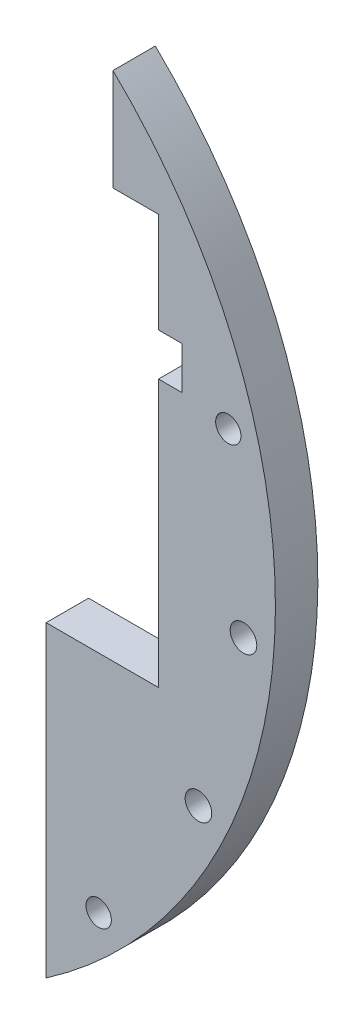
ISO-10303-21;
HEADER;
FILE_DESCRIPTION(('STEP AP214'),'2;1');
FILE_NAME('part.step','',(''),(''),'','','');
FILE_SCHEMA(('AUTOMOTIVE_DESIGN { 1 0 10303 214 1 1 1 1 }'));
ENDSEC;
DATA;
#1=APPLICATION_CONTEXT('core data for automotive mechanical design processes');
#2=APPLICATION_PROTOCOL_DEFINITION('international standard','automotive_design',2000,#1);
#3=PRODUCT_CONTEXT('',#1,'mechanical');
#4=PRODUCT('Part','Part','',(#3));
#5=PRODUCT_RELATED_PRODUCT_CATEGORY('part','',(#4));
#6=PRODUCT_DEFINITION_FORMATION('','',#4);
#7=PRODUCT_DEFINITION_CONTEXT('part definition',#1,'design');
#8=PRODUCT_DEFINITION('design','',#6,#7);
#9=PRODUCT_DEFINITION_SHAPE('','',#8);
#10=(LENGTH_UNIT() NAMED_UNIT(*) SI_UNIT(.MILLI.,.METRE.));
#11=(NAMED_UNIT(*) PLANE_ANGLE_UNIT() SI_UNIT($,.RADIAN.));
#12=(NAMED_UNIT(*) SI_UNIT($,.STERADIAN.) SOLID_ANGLE_UNIT());
#13=UNCERTAINTY_MEASURE_WITH_UNIT(LENGTH_MEASURE(1.E-05),#10,'distance_accuracy_value','');
#14=(GEOMETRIC_REPRESENTATION_CONTEXT(3) GLOBAL_UNCERTAINTY_ASSIGNED_CONTEXT((#13)) GLOBAL_UNIT_ASSIGNED_CONTEXT((#10,
#11,#12)) REPRESENTATION_CONTEXT('',''));
#15=CARTESIAN_POINT('',(0.,0.,0.));
#16=DIRECTION('',(0.,0.,1.));
#17=DIRECTION('',(1.,0.,0.));
#18=AXIS2_PLACEMENT_3D('',#15,#16,#17);
#19=CARTESIAN_POINT('',(0.,0.,6.35));
#20=DIRECTION('',(0.,0.,1.));
#21=DIRECTION('',(1.,0.,0.));
#22=AXIS2_PLACEMENT_3D('',#19,#20,#21);
#23=PLANE('',#22);
#24=CARTESIAN_POINT('',(74.714602356881,-6.53668070607368,6.35));
#25=DIRECTION('',(0.,0.,1.));
#26=DIRECTION('',(1.,0.,0.));
#27=AXIS2_PLACEMENT_3D('',#24,#25,#26);
#28=CIRCLE('',#27,1.99389999999999);
#29=CARTESIAN_POINT('',(76.708502356881,-6.53668070607368,6.35));
#30=VERTEX_POINT('',#29);
#31=EDGE_CURVE('E146',#30,#30,#28,.T.);
#32=ORIENTED_EDGE('',*,*,#31,.F.);
#33=EDGE_LOOP('',(#32));
#34=FACE_BOUND('',#33,.T.);
#35=CARTESIAN_POINT('',(72.4444369716801,19.4114283826893,6.35));
#36=DIRECTION('',(0.,0.,1.));
#37=DIRECTION('',(1.,0.,0.));
#38=AXIS2_PLACEMENT_3D('',#35,#36,#37);
#39=CIRCLE('',#38,1.89865000000001);
#40=CARTESIAN_POINT('',(74.3430869716801,19.4114283826893,6.35));
#41=VERTEX_POINT('',#40);
#42=EDGE_CURVE('E196',#41,#41,#39,.T.);
#43=ORIENTED_EDGE('',*,*,#42,.F.);
#44=EDGE_LOOP('',(#43));
#45=FACE_BOUND('',#44,.T.);
#46=CARTESIAN_POINT('',(67.973084027749,-31.6963696305519,6.35));
#47=DIRECTION('',(0.,0.,1.));
#48=DIRECTION('',(1.,0.,0.));
#49=AXIS2_PLACEMENT_3D('',#46,#47,#48);
#50=CIRCLE('',#49,1.99389999999999);
#51=CARTESIAN_POINT('',(69.966984027749,-31.6963696305519,6.35));
#52=VERTEX_POINT('',#51);
#53=EDGE_CURVE('E190',#52,#52,#50,.T.);
#54=ORIENTED_EDGE('',*,*,#53,.F.);
#55=EDGE_LOOP('',(#54));
#56=FACE_BOUND('',#55,.T.);
#57=CARTESIAN_POINT('',(53.0330085889911,-53.0330085889911,6.35));
#58=DIRECTION('',(0.,0.,1.));
#59=DIRECTION('',(1.,0.,0.));
#60=AXIS2_PLACEMENT_3D('',#57,#58,#59);
#61=CIRCLE('',#60,1.89865);
#62=CARTESIAN_POINT('',(54.9316585889911,-53.0330085889911,6.35));
#63=VERTEX_POINT('',#62);
#64=EDGE_CURVE('E159',#63,#63,#61,.T.);
#65=ORIENTED_EDGE('',*,*,#64,.F.);
#66=EDGE_LOOP('',(#65));
#67=FACE_BOUND('',#66,.T.);
#68=DIRECTION('',(1.,0.,0.));
#69=VECTOR('',#68,1.);
#70=CARTESIAN_POINT('',(33.5,-19.35,6.35));
#71=LINE('',#70,#69);
#72=CARTESIAN_POINT('',(45.175,-19.35,6.35));
#73=VERTEX_POINT('',#72);
#74=CARTESIAN_POINT('',(62.,-19.35,6.35));
#75=VERTEX_POINT('',#74);
#76=EDGE_CURVE('E142',#73,#75,#71,.T.);
#77=ORIENTED_EDGE('',*,*,#76,.F.);
#78=DIRECTION('',(0.,1.,0.));
#79=VECTOR('',#78,1.);
#80=CARTESIAN_POINT('',(45.175,-14.0295402146267,6.35));
#81=LINE('',#80,#79);
#82=CARTESIAN_POINT('',(45.175,-65.4176533895859,6.35));
#83=VERTEX_POINT('',#82);
#84=EDGE_CURVE('E11',#83,#73,#81,.T.);
#85=ORIENTED_EDGE('',*,*,#84,.F.);
#86=CARTESIAN_POINT('',(0.,0.,6.35));
#87=DIRECTION('',(0.,0.,1.));
#88=DIRECTION('',(1.,0.,0.));
#89=AXIS2_PLACEMENT_3D('',#86,#87,#88);
#90=CIRCLE('',#89,79.5);
#91=CARTESIAN_POINT('',(55.175,57.2360845533655,6.35));
#92=VERTEX_POINT('',#91);
#93=EDGE_CURVE('E148',#83,#92,#90,.T.);
#94=ORIENTED_EDGE('',*,*,#93,.T.);
#95=DIRECTION('',(0.,1.,0.));
#96=VECTOR('',#95,1.);
#97=CARTESIAN_POINT('',(55.175,2.,6.35));
#98=LINE('',#97,#96);
#99=CARTESIAN_POINT('',(55.175,42.,6.35));
#100=VERTEX_POINT('',#99);
#101=EDGE_CURVE('E132',#100,#92,#98,.T.);
#102=ORIENTED_EDGE('',*,*,#101,.F.);
#103=DIRECTION('',(-1.,0.,0.));
#104=VECTOR('',#103,1.);
#105=CARTESIAN_POINT('',(62.,42.,6.35));
#106=LINE('',#105,#104);
#107=CARTESIAN_POINT('',(62.,42.,6.35));
#108=VERTEX_POINT('',#107);
#109=EDGE_CURVE('E131',#108,#100,#106,.T.);
#110=ORIENTED_EDGE('',*,*,#109,.F.);
#111=DIRECTION('',(0.,1.,0.));
#112=VECTOR('',#111,1.);
#113=CARTESIAN_POINT('',(62.,27.,6.35));
#114=LINE('',#113,#112);
#115=CARTESIAN_POINT('',(62.,27.,6.35));
#116=VERTEX_POINT('',#115);
#117=EDGE_CURVE('E169',#116,#108,#114,.T.);
#118=ORIENTED_EDGE('',*,*,#117,.F.);
#119=DIRECTION('',(-1.,0.,0.));
#120=VECTOR('',#119,1.);
#121=CARTESIAN_POINT('',(65.5,27.,6.35));
#122=LINE('',#121,#120);
#123=CARTESIAN_POINT('',(65.5,27.,6.35));
#124=VERTEX_POINT('',#123);
#125=EDGE_CURVE('E166',#124,#116,#122,.T.);
#126=ORIENTED_EDGE('',*,*,#125,.F.);
#127=DIRECTION('',(0.,1.,0.));
#128=VECTOR('',#127,1.);
#129=CARTESIAN_POINT('',(65.5,20.65,6.35));
#130=LINE('',#129,#128);
#131=CARTESIAN_POINT('',(65.5,20.65,6.35));
#132=VERTEX_POINT('',#131);
#133=EDGE_CURVE('E163',#132,#124,#130,.T.);
#134=ORIENTED_EDGE('',*,*,#133,.F.);
#135=DIRECTION('',(1.,0.,0.));
#136=VECTOR('',#135,1.);
#137=CARTESIAN_POINT('',(62.,20.65,6.35));
#138=LINE('',#137,#136);
#139=CARTESIAN_POINT('',(62.,20.65,6.35));
#140=VERTEX_POINT('',#139);
#141=EDGE_CURVE('E160',#140,#132,#138,.T.);
#142=ORIENTED_EDGE('',*,*,#141,.F.);
#143=DIRECTION('',(0.,1.,0.));
#144=VECTOR('',#143,1.);
#145=CARTESIAN_POINT('',(62.,-19.35,6.35));
#146=LINE('',#145,#144);
#147=EDGE_CURVE('E156',#75,#140,#146,.T.);
#148=ORIENTED_EDGE('',*,*,#147,.F.);
#149=EDGE_LOOP('',(#77,#85,#94,#102,#110,#118,#126,#134,#142,#148));
#150=FACE_BOUND('',#149,.T.);
#151=ADVANCED_FACE('F35',(#34,#45,#56,#67,#150),#23,.T.);
#152=CARTESIAN_POINT('',(0.,0.,0.));
#153=DIRECTION('',(0.,0.,1.));
#154=DIRECTION('',(1.,0.,0.));
#155=AXIS2_PLACEMENT_3D('',#152,#153,#154);
#156=PLANE('',#155);
#157=CARTESIAN_POINT('',(74.714602356881,-6.53668070607368,0.));
#158=DIRECTION('',(0.,0.,1.));
#159=DIRECTION('',(1.,0.,0.));
#160=AXIS2_PLACEMENT_3D('',#157,#158,#159);
#161=CIRCLE('',#160,1.99389999999999);
#162=CARTESIAN_POINT('',(76.708502356881,-6.53668070607368,0.));
#163=VERTEX_POINT('',#162);
#164=EDGE_CURVE('E149',#163,#163,#161,.T.);
#165=ORIENTED_EDGE('',*,*,#164,.T.);
#166=EDGE_LOOP('',(#165));
#167=FACE_BOUND('',#166,.T.);
#168=CARTESIAN_POINT('',(72.4444369716801,19.4114283826893,0.));
#169=DIRECTION('',(0.,0.,1.));
#170=DIRECTION('',(1.,0.,0.));
#171=AXIS2_PLACEMENT_3D('',#168,#169,#170);
#172=CIRCLE('',#171,1.89865000000001);
#173=CARTESIAN_POINT('',(74.3430869716801,19.4114283826893,0.));
#174=VERTEX_POINT('',#173);
#175=EDGE_CURVE('E199',#174,#174,#172,.T.);
#176=ORIENTED_EDGE('',*,*,#175,.T.);
#177=EDGE_LOOP('',(#176));
#178=FACE_BOUND('',#177,.T.);
#179=CARTESIAN_POINT('',(67.973084027749,-31.6963696305519,0.));
#180=DIRECTION('',(0.,0.,1.));
#181=DIRECTION('',(1.,0.,0.));
#182=AXIS2_PLACEMENT_3D('',#179,#180,#181);
#183=CIRCLE('',#182,1.99389999999999);
#184=CARTESIAN_POINT('',(69.966984027749,-31.6963696305519,0.));
#185=VERTEX_POINT('',#184);
#186=EDGE_CURVE('E193',#185,#185,#183,.T.);
#187=ORIENTED_EDGE('',*,*,#186,.T.);
#188=EDGE_LOOP('',(#187));
#189=FACE_BOUND('',#188,.T.);
#190=CARTESIAN_POINT('',(53.0330085889911,-53.0330085889911,0.));
#191=DIRECTION('',(0.,0.,1.));
#192=DIRECTION('',(1.,0.,0.));
#193=AXIS2_PLACEMENT_3D('',#190,#191,#192);
#194=CIRCLE('',#193,1.89865);
#195=CARTESIAN_POINT('',(54.9316585889911,-53.0330085889911,0.));
#196=VERTEX_POINT('',#195);
#197=EDGE_CURVE('E152',#196,#196,#194,.T.);
#198=ORIENTED_EDGE('',*,*,#197,.T.);
#199=EDGE_LOOP('',(#198));
#200=FACE_BOUND('',#199,.T.);
#201=DIRECTION('',(0.,1.,0.));
#202=VECTOR('',#201,1.);
#203=CARTESIAN_POINT('',(45.175,-14.0295402146267,0.));
#204=LINE('',#203,#202);
#205=CARTESIAN_POINT('',(45.175,-65.4176533895859,0.));
#206=VERTEX_POINT('',#205);
#207=CARTESIAN_POINT('',(45.175,-19.35,0.));
#208=VERTEX_POINT('',#207);
#209=EDGE_CURVE('E51',#206,#208,#204,.T.);
#210=ORIENTED_EDGE('',*,*,#209,.T.);
#211=DIRECTION('',(1.,0.,0.));
#212=VECTOR('',#211,1.);
#213=CARTESIAN_POINT('',(33.5,-19.35,0.));
#214=LINE('',#213,#212);
#215=CARTESIAN_POINT('',(62.,-19.35,0.));
#216=VERTEX_POINT('',#215);
#217=EDGE_CURVE('E38',#208,#216,#214,.T.);
#218=ORIENTED_EDGE('',*,*,#217,.T.);
#219=DIRECTION('',(0.,1.,0.));
#220=VECTOR('',#219,1.);
#221=CARTESIAN_POINT('',(62.,-19.35,0.));
#222=LINE('',#221,#220);
#223=CARTESIAN_POINT('',(62.,20.65,0.));
#224=VERTEX_POINT('',#223);
#225=EDGE_CURVE('E171',#216,#224,#222,.T.);
#226=ORIENTED_EDGE('',*,*,#225,.T.);
#227=DIRECTION('',(1.,0.,0.));
#228=VECTOR('',#227,1.);
#229=CARTESIAN_POINT('',(62.,20.65,0.));
#230=LINE('',#229,#228);
#231=CARTESIAN_POINT('',(65.5,20.65,0.));
#232=VERTEX_POINT('',#231);
#233=EDGE_CURVE('E174',#224,#232,#230,.T.);
#234=ORIENTED_EDGE('',*,*,#233,.T.);
#235=DIRECTION('',(0.,1.,0.));
#236=VECTOR('',#235,1.);
#237=CARTESIAN_POINT('',(65.5,20.65,0.));
#238=LINE('',#237,#236);
#239=CARTESIAN_POINT('',(65.5,27.,0.));
#240=VERTEX_POINT('',#239);
#241=EDGE_CURVE('E177',#232,#240,#238,.T.);
#242=ORIENTED_EDGE('',*,*,#241,.T.);
#243=DIRECTION('',(-1.,0.,0.));
#244=VECTOR('',#243,1.);
#245=CARTESIAN_POINT('',(65.5,27.,0.));
#246=LINE('',#245,#244);
#247=CARTESIAN_POINT('',(62.,27.,0.));
#248=VERTEX_POINT('',#247);
#249=EDGE_CURVE('E139',#240,#248,#246,.T.);
#250=ORIENTED_EDGE('',*,*,#249,.T.);
#251=DIRECTION('',(0.,1.,0.));
#252=VECTOR('',#251,1.);
#253=CARTESIAN_POINT('',(62.,27.,0.));
#254=LINE('',#253,#252);
#255=CARTESIAN_POINT('',(62.,42.,0.));
#256=VERTEX_POINT('',#255);
#257=EDGE_CURVE('E138',#248,#256,#254,.T.);
#258=ORIENTED_EDGE('',*,*,#257,.T.);
#259=DIRECTION('',(-1.,0.,0.));
#260=VECTOR('',#259,1.);
#261=CARTESIAN_POINT('',(62.,42.,0.));
#262=LINE('',#261,#260);
#263=CARTESIAN_POINT('',(55.175,42.,0.));
#264=VERTEX_POINT('',#263);
#265=EDGE_CURVE('E122',#256,#264,#262,.T.);
#266=ORIENTED_EDGE('',*,*,#265,.T.);
#267=DIRECTION('',(0.,1.,0.));
#268=VECTOR('',#267,1.);
#269=CARTESIAN_POINT('',(55.175,2.,0.));
#270=LINE('',#269,#268);
#271=CARTESIAN_POINT('',(55.175,57.2360845533655,0.));
#272=VERTEX_POINT('',#271);
#273=EDGE_CURVE('E110',#264,#272,#270,.T.);
#274=ORIENTED_EDGE('',*,*,#273,.T.);
#275=CARTESIAN_POINT('',(0.,0.,0.));
#276=DIRECTION('',(0.,0.,1.));
#277=DIRECTION('',(1.,0.,0.));
#278=AXIS2_PLACEMENT_3D('',#275,#276,#277);
#279=CIRCLE('',#278,79.5);
#280=EDGE_CURVE('E121',#206,#272,#279,.T.);
#281=ORIENTED_EDGE('',*,*,#280,.F.);
#282=EDGE_LOOP('',(#210,#218,#226,#234,#242,#250,#258,#266,#274,#281));
#283=FACE_BOUND('',#282,.T.);
#284=ADVANCED_FACE('F135',(#167,#178,#189,#200,#283),#156,.F.);
#285=CARTESIAN_POINT('',(0.,0.,6.35));
#286=DIRECTION('',(0.,0.,-1.));
#287=DIRECTION('',(-1.,0.,0.));
#288=AXIS2_PLACEMENT_3D('',#285,#286,#287);
#289=CYLINDRICAL_SURFACE('',#288,79.5);
#290=DIRECTION('',(0.,0.,-1.));
#291=VECTOR('',#290,1.);
#292=CARTESIAN_POINT('',(45.175,-65.4176533895859,6.35));
#293=LINE('',#292,#291);
#294=EDGE_CURVE('E43',#206,#83,#293,.F.);
#295=ORIENTED_EDGE('',*,*,#294,.F.);
#296=ORIENTED_EDGE('',*,*,#280,.T.);
#297=DIRECTION('',(0.,0.,-1.));
#298=VECTOR('',#297,1.);
#299=CARTESIAN_POINT('',(55.175,57.2360845533655,6.35));
#300=LINE('',#299,#298);
#301=EDGE_CURVE('E117',#272,#92,#300,.F.);
#302=ORIENTED_EDGE('',*,*,#301,.T.);
#303=ORIENTED_EDGE('',*,*,#93,.F.);
#304=EDGE_LOOP('',(#295,#296,#302,#303));
#305=FACE_BOUND('',#304,.T.);
#306=ADVANCED_FACE('F229',(#305),#289,.T.);
#307=CARTESIAN_POINT('',(33.5,-19.35,6.35));
#308=DIRECTION('',(0.,1.,0.));
#309=DIRECTION('',(0.,0.,1.));
#310=AXIS2_PLACEMENT_3D('',#307,#308,#309);
#311=PLANE('',#310);
#312=ORIENTED_EDGE('',*,*,#217,.F.);
#313=DIRECTION('',(0.,0.,1.));
#314=VECTOR('',#313,1.);
#315=CARTESIAN_POINT('',(45.175,-19.35,6.35));
#316=LINE('',#315,#314);
#317=EDGE_CURVE('E55',#208,#73,#316,.T.);
#318=ORIENTED_EDGE('',*,*,#317,.T.);
#319=ORIENTED_EDGE('',*,*,#76,.T.);
#320=DIRECTION('',(0.,0.,-1.));
#321=VECTOR('',#320,1.);
#322=CARTESIAN_POINT('',(62.,-19.35,6.35));
#323=LINE('',#322,#321);
#324=EDGE_CURVE('E144',#75,#216,#323,.T.);
#325=ORIENTED_EDGE('',*,*,#324,.T.);
#326=EDGE_LOOP('',(#312,#318,#319,#325));
#327=FACE_BOUND('',#326,.T.);
#328=ADVANCED_FACE('F211',(#327),#311,.T.);
#329=CARTESIAN_POINT('',(62.,42.,6.35));
#330=DIRECTION('',(0.,-1.,0.));
#331=DIRECTION('',(0.,0.,-1.));
#332=AXIS2_PLACEMENT_3D('',#329,#330,#331);
#333=PLANE('',#332);
#334=DIRECTION('',(0.,0.,1.));
#335=VECTOR('',#334,1.);
#336=CARTESIAN_POINT('',(55.175,42.,6.35));
#337=LINE('',#336,#335);
#338=EDGE_CURVE('E114',#264,#100,#337,.T.);
#339=ORIENTED_EDGE('',*,*,#338,.F.);
#340=ORIENTED_EDGE('',*,*,#265,.F.);
#341=DIRECTION('',(0.,0.,-1.));
#342=VECTOR('',#341,1.);
#343=CARTESIAN_POINT('',(62.,42.,6.35));
#344=LINE('',#343,#342);
#345=EDGE_CURVE('E133',#108,#256,#344,.T.);
#346=ORIENTED_EDGE('',*,*,#345,.F.);
#347=ORIENTED_EDGE('',*,*,#109,.T.);
#348=EDGE_LOOP('',(#339,#340,#346,#347));
#349=FACE_BOUND('',#348,.T.);
#350=ADVANCED_FACE('F127',(#349),#333,.T.);
#351=CARTESIAN_POINT('',(74.714602356881,-6.53668070607368,6.35));
#352=DIRECTION('',(0.,0.,-1.));
#353=DIRECTION('',(-1.,0.,0.));
#354=AXIS2_PLACEMENT_3D('',#351,#352,#353);
#355=CYLINDRICAL_SURFACE('',#354,1.99389999999999);
#356=ORIENTED_EDGE('',*,*,#31,.T.);
#357=EDGE_LOOP('',(#356));
#358=FACE_BOUND('',#357,.T.);
#359=ORIENTED_EDGE('',*,*,#164,.F.);
#360=EDGE_LOOP('',(#359));
#361=FACE_BOUND('',#360,.T.);
#362=ADVANCED_FACE('F339',(#358,#361),#355,.F.);
#363=CARTESIAN_POINT('',(72.4444369716801,19.4114283826893,6.35));
#364=DIRECTION('',(0.,0.,-1.));
#365=DIRECTION('',(-1.,0.,0.));
#366=AXIS2_PLACEMENT_3D('',#363,#364,#365);
#367=CYLINDRICAL_SURFACE('',#366,1.89865000000001);
#368=ORIENTED_EDGE('',*,*,#42,.T.);
#369=EDGE_LOOP('',(#368));
#370=FACE_BOUND('',#369,.T.);
#371=ORIENTED_EDGE('',*,*,#175,.F.);
#372=EDGE_LOOP('',(#371));
#373=FACE_BOUND('',#372,.T.);
#374=ADVANCED_FACE('F265',(#370,#373),#367,.F.);
#375=CARTESIAN_POINT('',(67.973084027749,-31.6963696305519,6.35));
#376=DIRECTION('',(0.,0.,-1.));
#377=DIRECTION('',(-1.,0.,0.));
#378=AXIS2_PLACEMENT_3D('',#375,#376,#377);
#379=CYLINDRICAL_SURFACE('',#378,1.99389999999999);
#380=ORIENTED_EDGE('',*,*,#53,.T.);
#381=EDGE_LOOP('',(#380));
#382=FACE_BOUND('',#381,.T.);
#383=ORIENTED_EDGE('',*,*,#186,.F.);
#384=EDGE_LOOP('',(#383));
#385=FACE_BOUND('',#384,.T.);
#386=ADVANCED_FACE('F256',(#382,#385),#379,.F.);
#387=CARTESIAN_POINT('',(53.0330085889911,-53.0330085889911,6.35));
#388=DIRECTION('',(0.,0.,-1.));
#389=DIRECTION('',(-1.,0.,0.));
#390=AXIS2_PLACEMENT_3D('',#387,#388,#389);
#391=CYLINDRICAL_SURFACE('',#390,1.89865);
#392=ORIENTED_EDGE('',*,*,#64,.T.);
#393=EDGE_LOOP('',(#392));
#394=FACE_BOUND('',#393,.T.);
#395=ORIENTED_EDGE('',*,*,#197,.F.);
#396=EDGE_LOOP('',(#395));
#397=FACE_BOUND('',#396,.T.);
#398=ADVANCED_FACE('F253',(#394,#397),#391,.F.);
#399=CARTESIAN_POINT('',(62.,-19.35,6.35));
#400=DIRECTION('',(-1.,0.,0.));
#401=DIRECTION('',(0.,-1.,0.));
#402=AXIS2_PLACEMENT_3D('',#399,#400,#401);
#403=PLANE('',#402);
#404=ORIENTED_EDGE('',*,*,#225,.F.);
#405=ORIENTED_EDGE('',*,*,#324,.F.);
#406=ORIENTED_EDGE('',*,*,#147,.T.);
#407=DIRECTION('',(0.,0.,-1.));
#408=VECTOR('',#407,1.);
#409=CARTESIAN_POINT('',(62.,20.65,6.35));
#410=LINE('',#409,#408);
#411=EDGE_CURVE('E158',#140,#224,#410,.T.);
#412=ORIENTED_EDGE('',*,*,#411,.T.);
#413=EDGE_LOOP('',(#404,#405,#406,#412));
#414=FACE_BOUND('',#413,.T.);
#415=ADVANCED_FACE('F222',(#414),#403,.T.);
#416=CARTESIAN_POINT('',(62.,20.65,6.35));
#417=DIRECTION('',(0.,1.,0.));
#418=DIRECTION('',(0.,0.,1.));
#419=AXIS2_PLACEMENT_3D('',#416,#417,#418);
#420=PLANE('',#419);
#421=ORIENTED_EDGE('',*,*,#233,.F.);
#422=ORIENTED_EDGE('',*,*,#411,.F.);
#423=ORIENTED_EDGE('',*,*,#141,.T.);
#424=DIRECTION('',(0.,0.,-1.));
#425=VECTOR('',#424,1.);
#426=CARTESIAN_POINT('',(65.5,20.65,6.35));
#427=LINE('',#426,#425);
#428=EDGE_CURVE('E162',#132,#232,#427,.T.);
#429=ORIENTED_EDGE('',*,*,#428,.T.);
#430=EDGE_LOOP('',(#421,#422,#423,#429));
#431=FACE_BOUND('',#430,.T.);
#432=ADVANCED_FACE('F225',(#431),#420,.T.);
#433=CARTESIAN_POINT('',(65.5,20.65,6.35));
#434=DIRECTION('',(-1.,0.,0.));
#435=DIRECTION('',(0.,0.,1.));
#436=AXIS2_PLACEMENT_3D('',#433,#434,#435);
#437=PLANE('',#436);
#438=ORIENTED_EDGE('',*,*,#241,.F.);
#439=ORIENTED_EDGE('',*,*,#428,.F.);
#440=ORIENTED_EDGE('',*,*,#133,.T.);
#441=DIRECTION('',(0.,0.,-1.));
#442=VECTOR('',#441,1.);
#443=CARTESIAN_POINT('',(65.5,27.,6.35));
#444=LINE('',#443,#442);
#445=EDGE_CURVE('E165',#124,#240,#444,.T.);
#446=ORIENTED_EDGE('',*,*,#445,.T.);
#447=EDGE_LOOP('',(#438,#439,#440,#446));
#448=FACE_BOUND('',#447,.T.);
#449=ADVANCED_FACE('F272',(#448),#437,.T.);
#450=CARTESIAN_POINT('',(65.5,27.,6.35));
#451=DIRECTION('',(0.,-1.,0.));
#452=DIRECTION('',(0.,0.,-1.));
#453=AXIS2_PLACEMENT_3D('',#450,#451,#452);
#454=PLANE('',#453);
#455=ORIENTED_EDGE('',*,*,#249,.F.);
#456=ORIENTED_EDGE('',*,*,#445,.F.);
#457=ORIENTED_EDGE('',*,*,#125,.T.);
#458=DIRECTION('',(0.,0.,-1.));
#459=VECTOR('',#458,1.);
#460=CARTESIAN_POINT('',(62.,27.,6.35));
#461=LINE('',#460,#459);
#462=EDGE_CURVE('E168',#116,#248,#461,.T.);
#463=ORIENTED_EDGE('',*,*,#462,.T.);
#464=EDGE_LOOP('',(#455,#456,#457,#463));
#465=FACE_BOUND('',#464,.T.);
#466=ADVANCED_FACE('F275',(#465),#454,.T.);
#467=CARTESIAN_POINT('',(62.,27.,6.35));
#468=DIRECTION('',(-1.,0.,0.));
#469=DIRECTION('',(0.,0.,1.));
#470=AXIS2_PLACEMENT_3D('',#467,#468,#469);
#471=PLANE('',#470);
#472=ORIENTED_EDGE('',*,*,#257,.F.);
#473=ORIENTED_EDGE('',*,*,#462,.F.);
#474=ORIENTED_EDGE('',*,*,#117,.T.);
#475=ORIENTED_EDGE('',*,*,#345,.T.);
#476=EDGE_LOOP('',(#472,#473,#474,#475));
#477=FACE_BOUND('',#476,.T.);
#478=ADVANCED_FACE('F236',(#477),#471,.T.);
#479=CARTESIAN_POINT('',(55.175,2.,0.));
#480=DIRECTION('',(1.,0.,0.));
#481=DIRECTION('',(0.,0.,-1.));
#482=AXIS2_PLACEMENT_3D('',#479,#480,#481);
#483=PLANE('',#482);
#484=ORIENTED_EDGE('',*,*,#273,.F.);
#485=ORIENTED_EDGE('',*,*,#338,.T.);
#486=ORIENTED_EDGE('',*,*,#101,.T.);
#487=ORIENTED_EDGE('',*,*,#301,.F.);
#488=EDGE_LOOP('',(#484,#485,#486,#487));
#489=FACE_BOUND('',#488,.T.);
#490=ADVANCED_FACE('F112',(#489),#483,.F.);
#491=CARTESIAN_POINT('',(45.175,-14.0295402146267,6.35));
#492=DIRECTION('',(-1.,0.,0.));
#493=DIRECTION('',(0.,-1.,0.));
#494=AXIS2_PLACEMENT_3D('',#491,#492,#493);
#495=PLANE('',#494);
#496=ORIENTED_EDGE('',*,*,#294,.T.);
#497=ORIENTED_EDGE('',*,*,#84,.T.);
#498=ORIENTED_EDGE('',*,*,#317,.F.);
#499=ORIENTED_EDGE('',*,*,#209,.F.);
#500=EDGE_LOOP('',(#496,#497,#498,#499));
#501=FACE_BOUND('',#500,.T.);
#502=ADVANCED_FACE('F230',(#501),#495,.T.);
#503=CLOSED_SHELL('',(#151,#284,#306,#328,#350,#362,#374,#386,#398,#415,#432,#449,#466,#478,
#490,#502));
#504=MANIFOLD_SOLID_BREP('B2',#503);
#505=ADVANCED_BREP_SHAPE_REPRESENTATION('',(#18,#504),#14);
#506=SHAPE_DEFINITION_REPRESENTATION(#9,#505);
ENDSEC;
END-ISO-10303-21;
